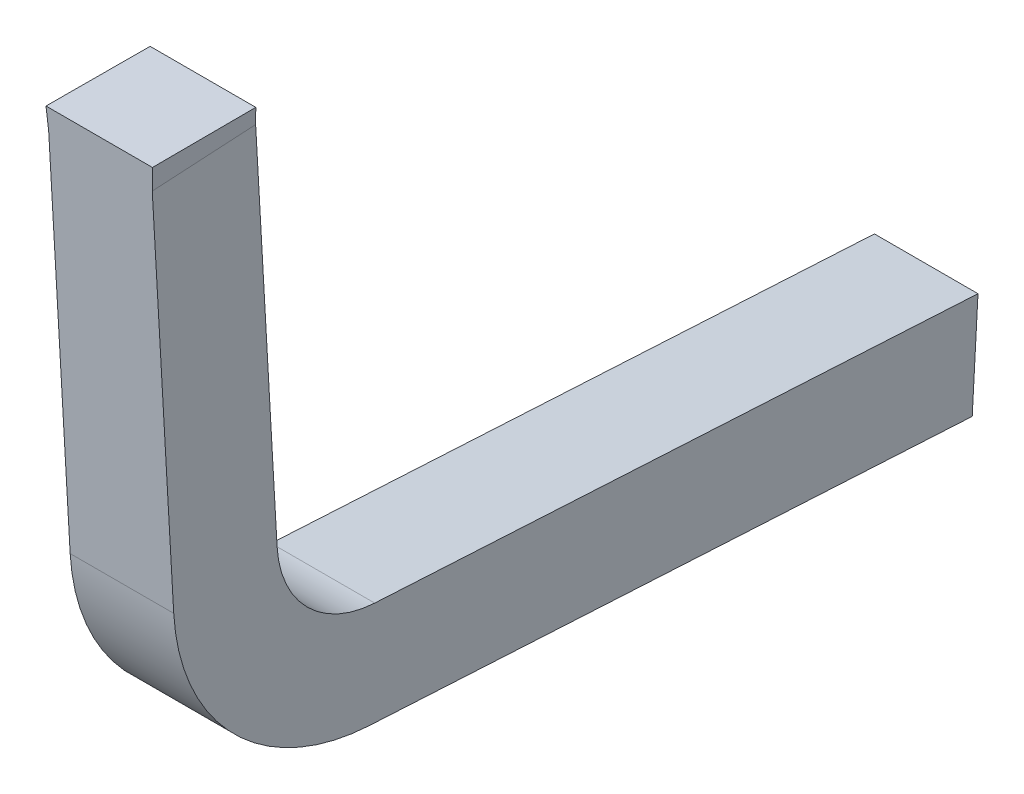
ISO-10303-21;
HEADER;
FILE_DESCRIPTION(('STEP AP214'),'2;1');
FILE_NAME('part.step','',(''),(''),'','','');
FILE_SCHEMA(('AUTOMOTIVE_DESIGN { 1 0 10303 214 1 1 1 1 }'));
ENDSEC;
DATA;
#1=APPLICATION_CONTEXT('core data for automotive mechanical design processes');
#2=APPLICATION_PROTOCOL_DEFINITION('international standard','automotive_design',2000,#1);
#3=PRODUCT_CONTEXT('',#1,'mechanical');
#4=PRODUCT('Part','Part','',(#3));
#5=PRODUCT_RELATED_PRODUCT_CATEGORY('part','',(#4));
#6=PRODUCT_DEFINITION_FORMATION('','',#4);
#7=PRODUCT_DEFINITION_CONTEXT('part definition',#1,'design');
#8=PRODUCT_DEFINITION('design','',#6,#7);
#9=PRODUCT_DEFINITION_SHAPE('','',#8);
#10=(LENGTH_UNIT() NAMED_UNIT(*) SI_UNIT(.MILLI.,.METRE.));
#11=(NAMED_UNIT(*) PLANE_ANGLE_UNIT() SI_UNIT($,.RADIAN.));
#12=(NAMED_UNIT(*) SI_UNIT($,.STERADIAN.) SOLID_ANGLE_UNIT());
#13=UNCERTAINTY_MEASURE_WITH_UNIT(LENGTH_MEASURE(1.E-05),#10,'distance_accuracy_value','');
#14=(GEOMETRIC_REPRESENTATION_CONTEXT(3) GLOBAL_UNCERTAINTY_ASSIGNED_CONTEXT((#13)) GLOBAL_UNIT_ASSIGNED_CONTEXT((#10,
#11,#12)) REPRESENTATION_CONTEXT('',''));
#15=CARTESIAN_POINT('',(0.,0.,0.));
#16=DIRECTION('',(0.,0.,1.));
#17=DIRECTION('',(1.,0.,0.));
#18=AXIS2_PLACEMENT_3D('',#15,#16,#17);
#19=CARTESIAN_POINT('',(-1.601406834182,-2.29897527843,-10.34781984343));
#20=DIRECTION('',(0.997785157857701,0.0664110878974701,0.003787632922693));
#21=DIRECTION('',(-0.0664115642747469,0.997792315129046,0.));
#22=AXIS2_PLACEMENT_3D('',#19,#20,#21);
#23=PLANE('',#22);
#24=DIRECTION('',(0.,-0.0569406083110753,0.998377567418842));
#25=VECTOR('',#24,1.);
#26=CARTESIAN_POINT('',(-1.6,-2.314349492935,-10.44885919008));
#27=LINE('',#26,#25);
#28=CARTESIAN_POINT('',(-1.6,-2.31434949293492,-10.4488591900814));
#29=VERTEX_POINT('',#28);
#30=CARTESIAN_POINT('',(-1.6,-2.32573761459728,-10.2491836765951));
#31=VERTEX_POINT('',#30);
#32=EDGE_CURVE('E98',#29,#31,#27,.T.);
#33=ORIENTED_EDGE('',*,*,#32,.T.);
#34=DIRECTION('',(0.0665190105147783,-0.996166318707982,-0.056814493854309));
#35=VECTOR('',#34,1.);
#36=CARTESIAN_POINT('',(-1.602813668365,-2.28360106392498,-10.2467804967704));
#37=LINE('',#36,#35);
#38=CARTESIAN_POINT('',(-1.602813668365,-2.28360106392499,-10.2467804967704));
#39=VERTEX_POINT('',#38);
#40=EDGE_CURVE('E148',#39,#31,#37,.T.);
#41=ORIENTED_EDGE('',*,*,#40,.F.);
#42=DIRECTION('',(-0.00379601320157547,0.,0.999992795115932));
#43=VECTOR('',#42,1.);
#44=CARTESIAN_POINT('',(-1.602053226489,-2.283601063925,-10.4471055106));
#45=LINE('',#44,#43);
#46=CARTESIAN_POINT('',(-1.602053226489,-2.28360106392489,-10.4471055106019));
#47=VERTEX_POINT('',#46);
#48=EDGE_CURVE('E161',#47,#39,#45,.T.);
#49=ORIENTED_EDGE('',*,*,#48,.F.);
#50=DIRECTION('',(0.0665190105273673,-0.996166318707226,-0.0568144938528306));
#51=VECTOR('',#50,1.);
#52=CARTESIAN_POINT('',(-1.602053226489,-2.28360106392483,-10.4471055106029));
#53=LINE('',#52,#51);
#54=EDGE_CURVE('E103',#47,#29,#53,.T.);
#55=ORIENTED_EDGE('',*,*,#54,.T.);
#56=EDGE_LOOP('',(#33,#41,#49,#55));
#57=FACE_BOUND('',#56,.T.);
#58=ADVANCED_FACE('F17',(#57),#23,.F.);
#59=CARTESIAN_POINT('',(-1.5,-2.283601063925,-10.34694300368));
#60=DIRECTION('',(0.,1.,0.));
#61=DIRECTION('',(0.,0.,1.));
#62=AXIS2_PLACEMENT_3D('',#59,#60,#61);
#63=PLANE('',#62);
#64=DIRECTION('',(1.,0.,0.));
#65=VECTOR('',#64,1.);
#66=CARTESIAN_POINT('',(-1.5,-2.28360106392498,-10.2467804967704));
#67=LINE('',#66,#65);
#68=CARTESIAN_POINT('',(-1.39718633163476,-2.283601063925,-10.2467804967704));
#69=VERTEX_POINT('',#68);
#70=EDGE_CURVE('E154',#69,#39,#67,.F.);
#71=ORIENTED_EDGE('',*,*,#70,.F.);
#72=DIRECTION('',(0.0037960132042621,-1.7968426456006E-13,0.999992795115921));
#73=VECTOR('',#72,1.);
#74=CARTESIAN_POINT('',(-1.3979467735108,-2.28360106392501,-10.4471055106));
#75=LINE('',#74,#73);
#76=CARTESIAN_POINT('',(-1.39794677351087,-2.28360106392495,-10.447105510601));
#77=VERTEX_POINT('',#76);
#78=EDGE_CURVE('E119',#77,#69,#75,.T.);
#79=ORIENTED_EDGE('',*,*,#78,.F.);
#80=DIRECTION('',(1.,0.,0.));
#81=VECTOR('',#80,1.);
#82=CARTESIAN_POINT('',(-1.5,-2.28360106392483,-10.4471055106029));
#83=LINE('',#82,#81);
#84=EDGE_CURVE('E125',#77,#47,#83,.F.);
#85=ORIENTED_EDGE('',*,*,#84,.T.);
#86=ORIENTED_EDGE('',*,*,#48,.T.);
#87=EDGE_LOOP('',(#71,#79,#85,#86));
#88=FACE_BOUND('',#87,.T.);
#89=ADVANCED_FACE('F243',(#88),#63,.T.);
#90=CARTESIAN_POINT('',(-1.6,-2.909472777839,-11.05227927458));
#91=DIRECTION('',(1.,0.,0.));
#92=DIRECTION('',(0.,0.,-1.));
#93=AXIS2_PLACEMENT_3D('',#90,#91,#92);
#94=PLANE('',#93);
#95=CARTESIAN_POINT('',(-1.6,-3.03,-10.69));
#96=DIRECTION('',(-1.,0.,0.));
#97=DIRECTION('',(0.,0.,1.));
#98=AXIS2_PLACEMENT_3D('',#95,#96,#97);
#99=CIRCLE('',#98,0.4);
#100=CARTESIAN_POINT('',(-1.6,-3.05277624331319,-10.2906489730306));
#101=VERTEX_POINT('',#100);
#102=CARTESIAN_POINT('',(-1.6,-3.42937693582933,-10.6676826720305));
#103=VERTEX_POINT('',#102);
#104=EDGE_CURVE('E142',#101,#103,#99,.F.);
#105=ORIENTED_EDGE('',*,*,#104,.F.);
#106=DIRECTION('',(0.,-0.998377567418718,-0.056940608313261));
#107=VECTOR('',#106,1.);
#108=CARTESIAN_POINT('',(-1.6,-2.668188653621,-10.2687147349));
#109=LINE('',#108,#107);
#110=EDGE_CURVE('E145',#31,#101,#109,.T.);
#111=ORIENTED_EDGE('',*,*,#110,.F.);
#112=ORIENTED_EDGE('',*,*,#32,.F.);
#113=DIRECTION('',(0.,-0.998377567418801,-0.0569406083117901));
#114=VECTOR('',#113,1.);
#115=CARTESIAN_POINT('',(-1.6,-2.662494592804,-10.46871499856));
#116=LINE('',#115,#114);
#117=CARTESIAN_POINT('',(-1.6,-3.04138812167726,-10.4903244865168));
#118=VERTEX_POINT('',#117);
#119=EDGE_CURVE('E92',#29,#118,#116,.T.);
#120=ORIENTED_EDGE('',*,*,#119,.T.);
#121=CARTESIAN_POINT('',(-1.6,-3.03,-10.69));
#122=DIRECTION('',(-1.,0.,0.));
#123=DIRECTION('',(0.,0.,1.));
#124=AXIS2_PLACEMENT_3D('',#121,#122,#123);
#125=CIRCLE('',#124,0.2);
#126=CARTESIAN_POINT('',(-1.6,-3.22968846791482,-10.6788413360177));
#127=VERTEX_POINT('',#126);
#128=EDGE_CURVE('E20',#118,#127,#125,.F.);
#129=ORIENTED_EDGE('',*,*,#128,.T.);
#130=DIRECTION('',(0.,0.0557933199228295,0.998442339572991));
#131=VECTOR('',#130,1.);
#132=CARTESIAN_POINT('',(-1.6,-3.262244863925,-11.26145022621));
#133=LINE('',#132,#131);
#134=CARTESIAN_POINT('',(-1.6,-3.29480125993501,-11.8440591164004));
#135=VERTEX_POINT('',#134);
#136=EDGE_CURVE('E111',#135,#127,#133,.T.);
#137=ORIENTED_EDGE('',*,*,#136,.F.);
#138=DIRECTION('',(0.,-0.998442339574031,0.0557933199042218));
#139=VECTOR('',#138,1.);
#140=CARTESIAN_POINT('',(-1.6,-3.394645493892,-11.83847978441));
#141=LINE('',#140,#139);
#142=CARTESIAN_POINT('',(-1.6,-3.49448972784906,-11.8329004524196));
#143=VERTEX_POINT('',#142);
#144=EDGE_CURVE('E135',#135,#143,#141,.T.);
#145=ORIENTED_EDGE('',*,*,#144,.T.);
#146=DIRECTION('',(0.,0.055793319922371,0.998442339573017));
#147=VECTOR('',#146,1.);
#148=CARTESIAN_POINT('',(-1.6,-3.461933331839,-11.25029156222));
#149=LINE('',#148,#147);
#150=EDGE_CURVE('E140',#143,#103,#149,.T.);
#151=ORIENTED_EDGE('',*,*,#150,.T.);
#152=EDGE_LOOP('',(#105,#111,#112,#120,#129,#137,#145,#151));
#153=FACE_BOUND('',#152,.T.);
#154=ADVANCED_FACE('F95',(#153),#94,.F.);
#155=CARTESIAN_POINT('',(-1.5,-3.262244863925,-11.26145022621));
#156=DIRECTION('',(0.,0.998442339572991,-0.0557933199228295));
#157=DIRECTION('',(0.,0.0557933199228295,0.998442339572991));
#158=AXIS2_PLACEMENT_3D('',#155,#156,#157);
#159=PLANE('',#158);
#160=DIRECTION('',(0.,0.055793319922887,0.998442339572988));
#161=VECTOR('',#160,1.);
#162=CARTESIAN_POINT('',(-1.4,-3.294801259935,-11.8440591164));
#163=LINE('',#162,#161);
#164=CARTESIAN_POINT('',(-1.4,-3.29480125993501,-11.8440591164001));
#165=VERTEX_POINT('',#164);
#166=CARTESIAN_POINT('',(-1.4,-3.2296884679148,-10.6788413360177));
#167=VERTEX_POINT('',#166);
#168=EDGE_CURVE('E129',#165,#167,#163,.T.);
#169=ORIENTED_EDGE('',*,*,#168,.F.);
#170=DIRECTION('',(1.,0.,0.));
#171=VECTOR('',#170,1.);
#172=CARTESIAN_POINT('',(-1.5,-3.29480125993502,-11.8440591164004));
#173=LINE('',#172,#171);
#174=EDGE_CURVE('E126',#165,#135,#173,.F.);
#175=ORIENTED_EDGE('',*,*,#174,.T.);
#176=ORIENTED_EDGE('',*,*,#136,.T.);
#177=DIRECTION('',(-1.,0.,0.));
#178=VECTOR('',#177,1.);
#179=CARTESIAN_POINT('',(-1.396,-3.22968846791485,-10.67884133602));
#180=LINE('',#179,#178);
#181=EDGE_CURVE('E110',#127,#167,#180,.F.);
#182=ORIENTED_EDGE('',*,*,#181,.T.);
#183=EDGE_LOOP('',(#169,#175,#176,#182));
#184=FACE_BOUND('',#183,.T.);
#185=ADVANCED_FACE('F234',(#184),#159,.T.);
#186=CARTESIAN_POINT('',(-1.396,-3.03,-10.69));
#187=DIRECTION('',(-1.,0.,0.));
#188=DIRECTION('',(0.,0.,1.));
#189=AXIS2_PLACEMENT_3D('',#186,#187,#188);
#190=CYLINDRICAL_SURFACE('',#189,0.2);
#191=ORIENTED_EDGE('',*,*,#128,.F.);
#192=DIRECTION('',(1.,0.,0.));
#193=VECTOR('',#192,1.);
#194=CARTESIAN_POINT('',(-1.5,-3.04138812169214,-10.4903244865176));
#195=LINE('',#194,#193);
#196=CARTESIAN_POINT('',(-1.4,-3.04138812167779,-10.490324486518));
#197=VERTEX_POINT('',#196);
#198=EDGE_CURVE('E102',#118,#197,#195,.T.);
#199=ORIENTED_EDGE('',*,*,#198,.T.);
#200=CARTESIAN_POINT('',(-1.4,-3.03,-10.69));
#201=DIRECTION('',(-1.,0.,0.));
#202=DIRECTION('',(0.,0.,1.));
#203=AXIS2_PLACEMENT_3D('',#200,#201,#202);
#204=CIRCLE('',#203,0.2);
#205=EDGE_CURVE('E185',#167,#197,#204,.T.);
#206=ORIENTED_EDGE('',*,*,#205,.F.);
#207=ORIENTED_EDGE('',*,*,#181,.F.);
#208=EDGE_LOOP('',(#191,#199,#206,#207));
#209=FACE_BOUND('',#208,.T.);
#210=ADVANCED_FACE('F107',(#209),#190,.F.);
#211=CARTESIAN_POINT('',(-1.5,-2.662494592804,-10.46871499856));
#212=DIRECTION('',(0.,-0.0569406083117901,0.998377567418801));
#213=DIRECTION('',(0.,-0.998377567418801,-0.0569406083117901));
#214=AXIS2_PLACEMENT_3D('',#211,#212,#213);
#215=PLANE('',#214);
#216=DIRECTION('',(0.,0.998377567418456,0.0569406083178453));
#217=VECTOR('',#216,1.);
#218=CARTESIAN_POINT('',(-1.4,-3.041388121692,-10.49032448652));
#219=LINE('',#218,#217);
#220=CARTESIAN_POINT('',(-1.39999999999992,-2.314349492934,-10.44885919008));
#221=VERTEX_POINT('',#220);
#222=EDGE_CURVE('E114',#197,#221,#219,.T.);
#223=ORIENTED_EDGE('',*,*,#222,.F.);
#224=ORIENTED_EDGE('',*,*,#198,.F.);
#225=ORIENTED_EDGE('',*,*,#119,.F.);
#226=ORIENTED_EDGE('',*,*,#54,.F.);
#227=ORIENTED_EDGE('',*,*,#84,.F.);
#228=DIRECTION('',(0.0665190105284185,0.996166318705548,0.0568144938810224));
#229=VECTOR('',#228,1.);
#230=CARTESIAN_POINT('',(-1.39999999999977,-2.31434949293401,-10.44885919008));
#231=LINE('',#230,#229);
#232=EDGE_CURVE('E116',#221,#77,#231,.T.);
#233=ORIENTED_EDGE('',*,*,#232,.F.);
#234=EDGE_LOOP('',(#223,#224,#225,#226,#227,#233));
#235=FACE_BOUND('',#234,.T.);
#236=ADVANCED_FACE('F112',(#235),#215,.F.);
#237=CARTESIAN_POINT('',(-1.398593165817,-2.298975278429,-10.34781984343));
#238=DIRECTION('',(0.9977851578563,-0.06641108791847,-0.003787632923708));
#239=DIRECTION('',(0.0664115642957472,0.997792315127648,0.));
#240=AXIS2_PLACEMENT_3D('',#237,#238,#239);
#241=PLANE('',#240);
#242=ORIENTED_EDGE('',*,*,#232,.T.);
#243=ORIENTED_EDGE('',*,*,#78,.T.);
#244=DIRECTION('',(0.0665190105179116,0.996166318707773,0.0568144938543194));
#245=VECTOR('',#244,1.);
#246=CARTESIAN_POINT('',(-1.4,-2.32573761459528,-10.249183676595));
#247=LINE('',#246,#245);
#248=CARTESIAN_POINT('',(-1.4,-2.32573761459509,-10.2491836765983));
#249=VERTEX_POINT('',#248);
#250=EDGE_CURVE('E147',#249,#69,#247,.T.);
#251=ORIENTED_EDGE('',*,*,#250,.F.);
#252=DIRECTION('',(0.,-0.0569406083060912,0.998377567419126));
#253=VECTOR('',#252,1.);
#254=CARTESIAN_POINT('',(-1.4,-2.314349492934,-10.44885919008));
#255=LINE('',#254,#253);
#256=EDGE_CURVE('E200',#221,#249,#255,.T.);
#257=ORIENTED_EDGE('',*,*,#256,.F.);
#258=EDGE_LOOP('',(#242,#243,#251,#257));
#259=FACE_BOUND('',#258,.T.);
#260=ADVANCED_FACE('F258',(#259),#241,.T.);
#261=CARTESIAN_POINT('',(-1.5,-2.668188653621,-10.2687147349));
#262=DIRECTION('',(0.,-0.056940608313261,0.998377567418718));
#263=DIRECTION('',(0.,-0.998377567418718,-0.056940608313261));
#264=AXIS2_PLACEMENT_3D('',#261,#262,#263);
#265=PLANE('',#264);
#266=ORIENTED_EDGE('',*,*,#250,.T.);
#267=ORIENTED_EDGE('',*,*,#70,.T.);
#268=ORIENTED_EDGE('',*,*,#40,.T.);
#269=ORIENTED_EDGE('',*,*,#110,.T.);
#270=DIRECTION('',(-1.,0.,0.));
#271=VECTOR('',#270,1.);
#272=CARTESIAN_POINT('',(-1.396,-3.05277624330094,-10.2906489730311));
#273=LINE('',#272,#271);
#274=CARTESIAN_POINT('',(-1.4,-3.05277624331214,-10.2906489730312));
#275=VERTEX_POINT('',#274);
#276=EDGE_CURVE('E157',#275,#101,#273,.T.);
#277=ORIENTED_EDGE('',*,*,#276,.F.);
#278=DIRECTION('',(0.,-0.998377567419005,-0.0569406083082185));
#279=VECTOR('',#278,1.);
#280=CARTESIAN_POINT('',(-1.4,-2.325737614595,-10.2491836766));
#281=LINE('',#280,#279);
#282=EDGE_CURVE('E184',#249,#275,#281,.T.);
#283=ORIENTED_EDGE('',*,*,#282,.F.);
#284=EDGE_LOOP('',(#266,#267,#268,#269,#277,#283));
#285=FACE_BOUND('',#284,.T.);
#286=ADVANCED_FACE('F227',(#285),#265,.T.);
#287=CARTESIAN_POINT('',(-1.396,-3.03,-10.69));
#288=DIRECTION('',(-1.,0.,0.));
#289=DIRECTION('',(0.,0.,1.));
#290=AXIS2_PLACEMENT_3D('',#287,#288,#289);
#291=CYLINDRICAL_SURFACE('',#290,0.4);
#292=DIRECTION('',(1.,0.,0.));
#293=VECTOR('',#292,1.);
#294=CARTESIAN_POINT('',(-1.5,-3.4293769358293,-10.66768267203));
#295=LINE('',#294,#293);
#296=CARTESIAN_POINT('',(-1.4,-3.42937693582946,-10.6676826720306));
#297=VERTEX_POINT('',#296);
#298=EDGE_CURVE('E137',#103,#297,#295,.T.);
#299=ORIENTED_EDGE('',*,*,#298,.T.);
#300=CARTESIAN_POINT('',(-1.4,-3.03,-10.69));
#301=DIRECTION('',(-1.,0.,0.));
#302=DIRECTION('',(0.,0.,1.));
#303=AXIS2_PLACEMENT_3D('',#300,#301,#302);
#304=CIRCLE('',#303,0.4);
#305=EDGE_CURVE('E181',#275,#297,#304,.F.);
#306=ORIENTED_EDGE('',*,*,#305,.F.);
#307=ORIENTED_EDGE('',*,*,#276,.T.);
#308=ORIENTED_EDGE('',*,*,#104,.T.);
#309=EDGE_LOOP('',(#299,#306,#307,#308));
#310=FACE_BOUND('',#309,.T.);
#311=ADVANCED_FACE('F220',(#310),#291,.T.);
#312=CARTESIAN_POINT('',(-1.5,-3.461933331839,-11.25029156222));
#313=DIRECTION('',(0.,0.998442339573017,-0.055793319922371));
#314=DIRECTION('',(0.,0.055793319922371,0.998442339573017));
#315=AXIS2_PLACEMENT_3D('',#312,#313,#314);
#316=PLANE('',#315);
#317=ORIENTED_EDGE('',*,*,#298,.F.);
#318=ORIENTED_EDGE('',*,*,#150,.F.);
#319=DIRECTION('',(1.,0.,0.));
#320=VECTOR('',#319,1.);
#321=CARTESIAN_POINT('',(-1.5,-3.49448972784898,-11.8329004524196));
#322=LINE('',#321,#320);
#323=CARTESIAN_POINT('',(-1.4,-3.49448972784899,-11.8329004524199));
#324=VERTEX_POINT('',#323);
#325=EDGE_CURVE('E35',#143,#324,#322,.T.);
#326=ORIENTED_EDGE('',*,*,#325,.T.);
#327=DIRECTION('',(0.,-0.0557933199219327,-0.998442339573042));
#328=VECTOR('',#327,1.);
#329=CARTESIAN_POINT('',(-1.4,-3.429376935829,-10.66768267202));
#330=LINE('',#329,#328);
#331=EDGE_CURVE('E26',#297,#324,#330,.T.);
#332=ORIENTED_EDGE('',*,*,#331,.F.);
#333=EDGE_LOOP('',(#317,#318,#326,#332));
#334=FACE_BOUND('',#333,.T.);
#335=ADVANCED_FACE('F222',(#334),#316,.F.);
#336=CARTESIAN_POINT('',(-1.5,-3.394645493892,-11.83847978441));
#337=DIRECTION('',(0.,0.0557933199042218,0.998442339574031));
#338=DIRECTION('',(0.,-0.998442339574031,0.0557933199042218));
#339=AXIS2_PLACEMENT_3D('',#336,#337,#338);
#340=PLANE('',#339);
#341=DIRECTION('',(0.,0.998442339574254,-0.0557933199002383));
#342=VECTOR('',#341,1.);
#343=CARTESIAN_POINT('',(-1.4,-3.494489727849,-11.83290045242));
#344=LINE('',#343,#342);
#345=EDGE_CURVE('E11',#324,#165,#344,.T.);
#346=ORIENTED_EDGE('',*,*,#345,.F.);
#347=ORIENTED_EDGE('',*,*,#325,.F.);
#348=ORIENTED_EDGE('',*,*,#144,.F.);
#349=ORIENTED_EDGE('',*,*,#174,.F.);
#350=EDGE_LOOP('',(#346,#347,#348,#349));
#351=FACE_BOUND('',#350,.T.);
#352=ADVANCED_FACE('F230',(#351),#340,.F.);
#353=CARTESIAN_POINT('',(-1.4,-2.909472777838,-11.05227927458));
#354=DIRECTION('',(1.,0.,0.));
#355=DIRECTION('',(0.,0.,-1.));
#356=AXIS2_PLACEMENT_3D('',#353,#354,#355);
#357=PLANE('',#356);
#358=ORIENTED_EDGE('',*,*,#331,.T.);
#359=ORIENTED_EDGE('',*,*,#345,.T.);
#360=ORIENTED_EDGE('',*,*,#168,.T.);
#361=ORIENTED_EDGE('',*,*,#205,.T.);
#362=ORIENTED_EDGE('',*,*,#222,.T.);
#363=ORIENTED_EDGE('',*,*,#256,.T.);
#364=ORIENTED_EDGE('',*,*,#282,.T.);
#365=ORIENTED_EDGE('',*,*,#305,.T.);
#366=EDGE_LOOP('',(#358,#359,#360,#361,#362,#363,#364,#365));
#367=FACE_BOUND('',#366,.T.);
#368=ADVANCED_FACE('F224',(#367),#357,.T.);
#369=CLOSED_SHELL('',(#58,#89,#154,#185,#210,#236,#260,#286,#311,#335,#352,#368));
#370=MANIFOLD_SOLID_BREP('B1',#369);
#371=ADVANCED_BREP_SHAPE_REPRESENTATION('',(#18,#370),#14);
#372=SHAPE_DEFINITION_REPRESENTATION(#9,#371);
ENDSEC;
END-ISO-10303-21;
